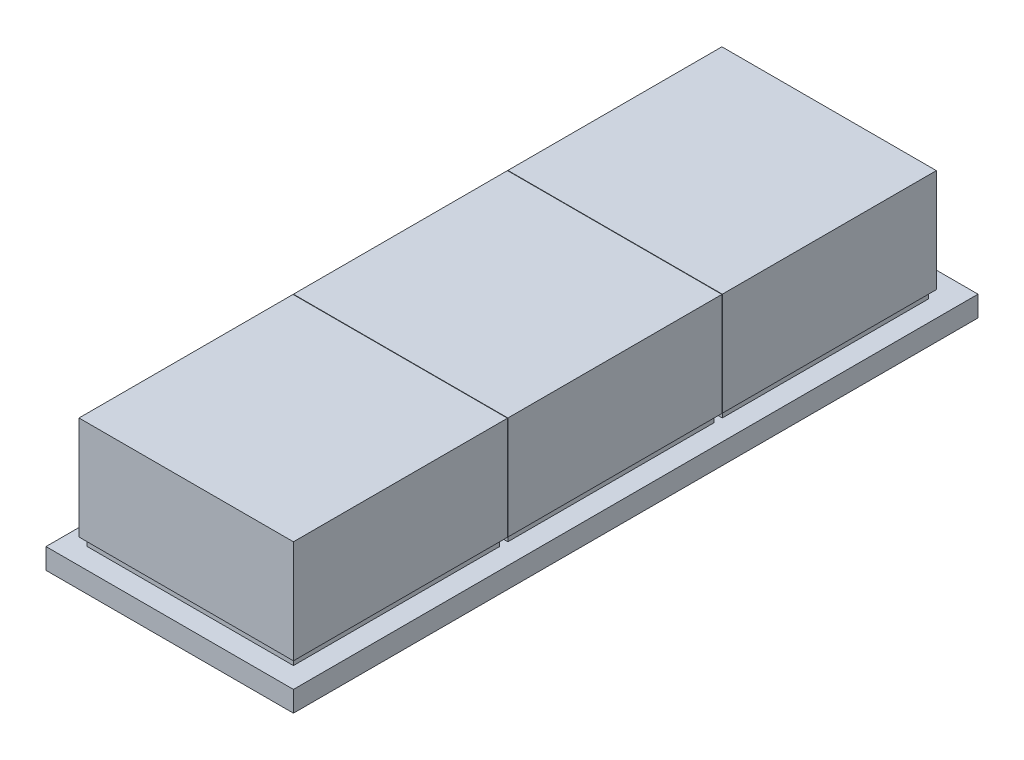
ISO-10303-21;
HEADER;
FILE_DESCRIPTION(('STEP AP214'),'2;1');
FILE_NAME('part.step','',(''),(''),'','','');
FILE_SCHEMA(('AUTOMOTIVE_DESIGN { 1 0 10303 214 1 1 1 1 }'));
ENDSEC;
DATA;
#1=APPLICATION_CONTEXT('core data for automotive mechanical design processes');
#2=APPLICATION_PROTOCOL_DEFINITION('international standard','automotive_design',2000,#1);
#3=PRODUCT_CONTEXT('',#1,'mechanical');
#4=PRODUCT('Part','Part','',(#3));
#5=PRODUCT_RELATED_PRODUCT_CATEGORY('part','',(#4));
#6=PRODUCT_DEFINITION_FORMATION('','',#4);
#7=PRODUCT_DEFINITION_CONTEXT('part definition',#1,'design');
#8=PRODUCT_DEFINITION('design','',#6,#7);
#9=PRODUCT_DEFINITION_SHAPE('','',#8);
#10=(LENGTH_UNIT() NAMED_UNIT(*) SI_UNIT(.MILLI.,.METRE.));
#11=(NAMED_UNIT(*) PLANE_ANGLE_UNIT() SI_UNIT($,.RADIAN.));
#12=(NAMED_UNIT(*) SI_UNIT($,.STERADIAN.) SOLID_ANGLE_UNIT());
#13=UNCERTAINTY_MEASURE_WITH_UNIT(LENGTH_MEASURE(1.E-05),#10,'distance_accuracy_value','');
#14=(GEOMETRIC_REPRESENTATION_CONTEXT(3) GLOBAL_UNCERTAINTY_ASSIGNED_CONTEXT((#13)) GLOBAL_UNIT_ASSIGNED_CONTEXT((#10,
#11,#12)) REPRESENTATION_CONTEXT('',''));
#15=CARTESIAN_POINT('',(0.,0.,0.));
#16=DIRECTION('',(0.,0.,1.));
#17=DIRECTION('',(1.,0.,0.));
#18=AXIS2_PLACEMENT_3D('',#15,#16,#17);
#19=CARTESIAN_POINT('',(-25.,7.,-26.));
#20=DIRECTION('',(0.,0.,-1.));
#21=DIRECTION('',(-1.,0.,0.));
#22=AXIS2_PLACEMENT_3D('',#19,#20,#21);
#23=PLANE('',#22);
#24=DIRECTION('',(1.,0.,0.));
#25=VECTOR('',#24,1.);
#26=CARTESIAN_POINT('',(-25.,5.,-26.));
#27=LINE('',#26,#25);
#28=CARTESIAN_POINT('',(-25.,5.,-26.));
#29=VERTEX_POINT('',#28);
#30=CARTESIAN_POINT('',(25.,5.,-26.));
#31=VERTEX_POINT('',#30);
#32=EDGE_CURVE('E418',#29,#31,#27,.T.);
#33=ORIENTED_EDGE('',*,*,#32,.T.);
#34=DIRECTION('',(0.,-1.,0.));
#35=VECTOR('',#34,1.);
#36=CARTESIAN_POINT('',(25.,7.,-26.));
#37=LINE('',#36,#35);
#38=CARTESIAN_POINT('',(25.,7.,-26.));
#39=VERTEX_POINT('',#38);
#40=EDGE_CURVE('E431',#39,#31,#37,.T.);
#41=ORIENTED_EDGE('',*,*,#40,.F.);
#42=DIRECTION('',(1.,0.,0.));
#43=VECTOR('',#42,1.);
#44=CARTESIAN_POINT('',(-25.,7.,-26.));
#45=LINE('',#44,#43);
#46=CARTESIAN_POINT('',(-25.,7.,-26.));
#47=VERTEX_POINT('',#46);
#48=EDGE_CURVE('E11',#47,#39,#45,.T.);
#49=ORIENTED_EDGE('',*,*,#48,.F.);
#50=DIRECTION('',(0.,-1.,0.));
#51=VECTOR('',#50,1.);
#52=CARTESIAN_POINT('',(-25.,7.,-26.));
#53=LINE('',#52,#51);
#54=EDGE_CURVE('E51',#47,#29,#53,.T.);
#55=ORIENTED_EDGE('',*,*,#54,.T.);
#56=EDGE_LOOP('',(#33,#41,#49,#55));
#57=FACE_BOUND('',#56,.T.);
#58=ADVANCED_FACE('F37',(#57),#23,.F.);
#59=CARTESIAN_POINT('',(-25.,7.,-76.));
#60=DIRECTION('',(1.,0.,0.));
#61=DIRECTION('',(0.,0.,-1.));
#62=AXIS2_PLACEMENT_3D('',#59,#60,#61);
#63=PLANE('',#62);
#64=DIRECTION('',(0.,0.,1.));
#65=VECTOR('',#64,1.);
#66=CARTESIAN_POINT('',(-25.,5.,-76.));
#67=LINE('',#66,#65);
#68=CARTESIAN_POINT('',(-25.,5.,-76.));
#69=VERTEX_POINT('',#68);
#70=EDGE_CURVE('E421',#69,#29,#67,.T.);
#71=ORIENTED_EDGE('',*,*,#70,.T.);
#72=ORIENTED_EDGE('',*,*,#54,.F.);
#73=DIRECTION('',(0.,0.,1.));
#74=VECTOR('',#73,1.);
#75=CARTESIAN_POINT('',(-25.,7.,-76.));
#76=LINE('',#75,#74);
#77=CARTESIAN_POINT('',(-25.,7.,-76.));
#78=VERTEX_POINT('',#77);
#79=EDGE_CURVE('E44',#78,#47,#76,.T.);
#80=ORIENTED_EDGE('',*,*,#79,.F.);
#81=DIRECTION('',(0.,-1.,0.));
#82=VECTOR('',#81,1.);
#83=CARTESIAN_POINT('',(-25.,7.,-76.));
#84=LINE('',#83,#82);
#85=EDGE_CURVE('E59',#78,#69,#84,.T.);
#86=ORIENTED_EDGE('',*,*,#85,.T.);
#87=EDGE_LOOP('',(#71,#72,#80,#86));
#88=FACE_BOUND('',#87,.T.);
#89=ADVANCED_FACE('F441',(#88),#63,.F.);
#90=CARTESIAN_POINT('',(-25.,7.,-76.));
#91=DIRECTION('',(0.,0.,1.));
#92=DIRECTION('',(1.,0.,0.));
#93=AXIS2_PLACEMENT_3D('',#90,#91,#92);
#94=PLANE('',#93);
#95=DIRECTION('',(-1.,0.,0.));
#96=VECTOR('',#95,1.);
#97=CARTESIAN_POINT('',(-25.,5.,-76.));
#98=LINE('',#97,#96);
#99=CARTESIAN_POINT('',(25.,5.,-76.));
#100=VERTEX_POINT('',#99);
#101=EDGE_CURVE('E423',#100,#69,#98,.T.);
#102=ORIENTED_EDGE('',*,*,#101,.T.);
#103=ORIENTED_EDGE('',*,*,#85,.F.);
#104=DIRECTION('',(-1.,0.,0.));
#105=VECTOR('',#104,1.);
#106=CARTESIAN_POINT('',(-25.,7.,-76.));
#107=LINE('',#106,#105);
#108=CARTESIAN_POINT('',(25.,7.,-76.));
#109=VERTEX_POINT('',#108);
#110=EDGE_CURVE('E435',#109,#78,#107,.T.);
#111=ORIENTED_EDGE('',*,*,#110,.F.);
#112=DIRECTION('',(0.,-1.,0.));
#113=VECTOR('',#112,1.);
#114=CARTESIAN_POINT('',(25.,7.,-76.));
#115=LINE('',#114,#113);
#116=EDGE_CURVE('E425',#109,#100,#115,.T.);
#117=ORIENTED_EDGE('',*,*,#116,.T.);
#118=EDGE_LOOP('',(#102,#103,#111,#117));
#119=FACE_BOUND('',#118,.T.);
#120=ADVANCED_FACE('F448',(#119),#94,.F.);
#121=CARTESIAN_POINT('',(25.,7.,-76.));
#122=DIRECTION('',(-1.,0.,0.));
#123=DIRECTION('',(0.,0.,1.));
#124=AXIS2_PLACEMENT_3D('',#121,#122,#123);
#125=PLANE('',#124);
#126=DIRECTION('',(0.,0.,-1.));
#127=VECTOR('',#126,1.);
#128=CARTESIAN_POINT('',(25.,5.,-76.));
#129=LINE('',#128,#127);
#130=EDGE_CURVE('E416',#31,#100,#129,.T.);
#131=ORIENTED_EDGE('',*,*,#130,.T.);
#132=ORIENTED_EDGE('',*,*,#116,.F.);
#133=DIRECTION('',(0.,0.,-1.));
#134=VECTOR('',#133,1.);
#135=CARTESIAN_POINT('',(25.,7.,-76.));
#136=LINE('',#135,#134);
#137=EDGE_CURVE('E428',#39,#109,#136,.T.);
#138=ORIENTED_EDGE('',*,*,#137,.F.);
#139=ORIENTED_EDGE('',*,*,#40,.T.);
#140=EDGE_LOOP('',(#131,#132,#138,#139));
#141=FACE_BOUND('',#140,.T.);
#142=ADVANCED_FACE('F447',(#141),#125,.F.);
#143=CARTESIAN_POINT('',(0.,5.,0.));
#144=DIRECTION('',(0.,-1.,0.));
#145=DIRECTION('',(0.,0.,-1.));
#146=AXIS2_PLACEMENT_3D('',#143,#144,#145);
#147=PLANE('',#146);
#148=DIRECTION('',(0.,0.,-1.));
#149=VECTOR('',#148,1.);
#150=CARTESIAN_POINT('',(25.,5.,28.));
#151=LINE('',#150,#149);
#152=CARTESIAN_POINT('',(25.,5.,78.));
#153=VERTEX_POINT('',#152);
#154=CARTESIAN_POINT('',(25.,5.,28.));
#155=VERTEX_POINT('',#154);
#156=EDGE_CURVE('E350',#153,#155,#151,.T.);
#157=ORIENTED_EDGE('',*,*,#156,.F.);
#158=DIRECTION('',(1.,0.,0.));
#159=VECTOR('',#158,1.);
#160=CARTESIAN_POINT('',(-25.,5.,78.));
#161=LINE('',#160,#159);
#162=CARTESIAN_POINT('',(-25.,5.,78.));
#163=VERTEX_POINT('',#162);
#164=EDGE_CURVE('E355',#163,#153,#161,.T.);
#165=ORIENTED_EDGE('',*,*,#164,.F.);
#166=DIRECTION('',(0.,0.,1.));
#167=VECTOR('',#166,1.);
#168=CARTESIAN_POINT('',(-25.,5.,28.));
#169=LINE('',#168,#167);
#170=CARTESIAN_POINT('',(-25.,5.,28.));
#171=VERTEX_POINT('',#170);
#172=EDGE_CURVE('E370',#171,#163,#169,.T.);
#173=ORIENTED_EDGE('',*,*,#172,.F.);
#174=DIRECTION('',(-1.,0.,0.));
#175=VECTOR('',#174,1.);
#176=CARTESIAN_POINT('',(-25.,5.,28.));
#177=LINE('',#176,#175);
#178=EDGE_CURVE('E367',#155,#171,#177,.T.);
#179=ORIENTED_EDGE('',*,*,#178,.F.);
#180=EDGE_LOOP('',(#157,#165,#173,#179));
#181=FACE_BOUND('',#180,.T.);
#182=DIRECTION('',(0.,0.,-1.));
#183=VECTOR('',#182,1.);
#184=CARTESIAN_POINT('',(30.,5.,83.));
#185=LINE('',#184,#183);
#186=CARTESIAN_POINT('',(30.,5.,83.));
#187=VERTEX_POINT('',#186);
#188=CARTESIAN_POINT('',(30.,5.,-83.));
#189=VERTEX_POINT('',#188);
#190=EDGE_CURVE('E387',#187,#189,#185,.T.);
#191=ORIENTED_EDGE('',*,*,#190,.T.);
#192=DIRECTION('',(-1.,0.,0.));
#193=VECTOR('',#192,1.);
#194=CARTESIAN_POINT('',(-30.,5.,-83.));
#195=LINE('',#194,#193);
#196=CARTESIAN_POINT('',(-30.,5.,-83.));
#197=VERTEX_POINT('',#196);
#198=EDGE_CURVE('E390',#189,#197,#195,.T.);
#199=ORIENTED_EDGE('',*,*,#198,.T.);
#200=DIRECTION('',(0.,0.,1.));
#201=VECTOR('',#200,1.);
#202=CARTESIAN_POINT('',(-30.,5.,83.));
#203=LINE('',#202,#201);
#204=CARTESIAN_POINT('',(-30.,5.,83.));
#205=VERTEX_POINT('',#204);
#206=EDGE_CURVE('E393',#197,#205,#203,.T.);
#207=ORIENTED_EDGE('',*,*,#206,.T.);
#208=DIRECTION('',(1.,0.,0.));
#209=VECTOR('',#208,1.);
#210=CARTESIAN_POINT('',(-30.,5.,83.));
#211=LINE('',#210,#209);
#212=EDGE_CURVE('E395',#205,#187,#211,.T.);
#213=ORIENTED_EDGE('',*,*,#212,.T.);
#214=EDGE_LOOP('',(#191,#199,#207,#213));
#215=FACE_BOUND('',#214,.T.);
#216=DIRECTION('',(0.,0.,-1.));
#217=VECTOR('',#216,1.);
#218=CARTESIAN_POINT('',(25.,5.,-24.));
#219=LINE('',#218,#217);
#220=CARTESIAN_POINT('',(25.,5.,26.));
#221=VERTEX_POINT('',#220);
#222=CARTESIAN_POINT('',(25.,5.,-24.));
#223=VERTEX_POINT('',#222);
#224=EDGE_CURVE('E347',#221,#223,#219,.T.);
#225=ORIENTED_EDGE('',*,*,#224,.F.);
#226=DIRECTION('',(1.,0.,0.));
#227=VECTOR('',#226,1.);
#228=CARTESIAN_POINT('',(-25.,5.,26.));
#229=LINE('',#228,#227);
#230=CARTESIAN_POINT('',(-25.,5.,26.));
#231=VERTEX_POINT('',#230);
#232=EDGE_CURVE('E314',#231,#221,#229,.T.);
#233=ORIENTED_EDGE('',*,*,#232,.F.);
#234=DIRECTION('',(0.,0.,1.));
#235=VECTOR('',#234,1.);
#236=CARTESIAN_POINT('',(-25.,5.,-24.));
#237=LINE('',#236,#235);
#238=CARTESIAN_POINT('',(-25.,5.,-24.));
#239=VERTEX_POINT('',#238);
#240=EDGE_CURVE('E335',#239,#231,#237,.T.);
#241=ORIENTED_EDGE('',*,*,#240,.F.);
#242=DIRECTION('',(-1.,0.,0.));
#243=VECTOR('',#242,1.);
#244=CARTESIAN_POINT('',(-25.,5.,-24.));
#245=LINE('',#244,#243);
#246=EDGE_CURVE('E341',#223,#239,#245,.T.);
#247=ORIENTED_EDGE('',*,*,#246,.F.);
#248=EDGE_LOOP('',(#225,#233,#241,#247));
#249=FACE_BOUND('',#248,.T.);
#250=ORIENTED_EDGE('',*,*,#130,.F.);
#251=ORIENTED_EDGE('',*,*,#32,.F.);
#252=ORIENTED_EDGE('',*,*,#70,.F.);
#253=ORIENTED_EDGE('',*,*,#101,.F.);
#254=EDGE_LOOP('',(#250,#251,#252,#253));
#255=FACE_BOUND('',#254,.T.);
#256=ADVANCED_FACE('F455',(#181,#215,#249,#255),#147,.F.);
#257=CARTESIAN_POINT('',(30.,5.,83.));
#258=DIRECTION('',(-1.,0.,0.));
#259=DIRECTION('',(0.,0.,1.));
#260=AXIS2_PLACEMENT_3D('',#257,#258,#259);
#261=PLANE('',#260);
#262=DIRECTION('',(0.,0.,-1.));
#263=VECTOR('',#262,1.);
#264=CARTESIAN_POINT('',(30.,0.,83.));
#265=LINE('',#264,#263);
#266=CARTESIAN_POINT('',(30.,0.,83.));
#267=VERTEX_POINT('',#266);
#268=CARTESIAN_POINT('',(30.,0.,-83.));
#269=VERTEX_POINT('',#268);
#270=EDGE_CURVE('E386',#267,#269,#265,.T.);
#271=ORIENTED_EDGE('',*,*,#270,.T.);
#272=DIRECTION('',(0.,-1.,0.));
#273=VECTOR('',#272,1.);
#274=CARTESIAN_POINT('',(30.,5.,-83.));
#275=LINE('',#274,#273);
#276=EDGE_CURVE('E413',#189,#269,#275,.T.);
#277=ORIENTED_EDGE('',*,*,#276,.F.);
#278=ORIENTED_EDGE('',*,*,#190,.F.);
#279=DIRECTION('',(0.,-1.,0.));
#280=VECTOR('',#279,1.);
#281=CARTESIAN_POINT('',(30.,5.,83.));
#282=LINE('',#281,#280);
#283=EDGE_CURVE('E397',#187,#267,#282,.T.);
#284=ORIENTED_EDGE('',*,*,#283,.T.);
#285=EDGE_LOOP('',(#271,#277,#278,#284));
#286=FACE_BOUND('',#285,.T.);
#287=ADVANCED_FACE('F736',(#286),#261,.F.);
#288=CARTESIAN_POINT('',(-30.,5.,-83.));
#289=DIRECTION('',(0.,0.,1.));
#290=DIRECTION('',(1.,0.,0.));
#291=AXIS2_PLACEMENT_3D('',#288,#289,#290);
#292=PLANE('',#291);
#293=DIRECTION('',(-1.,0.,0.));
#294=VECTOR('',#293,1.);
#295=CARTESIAN_POINT('',(-30.,0.,-83.));
#296=LINE('',#295,#294);
#297=CARTESIAN_POINT('',(-30.,0.,-83.));
#298=VERTEX_POINT('',#297);
#299=EDGE_CURVE('E400',#269,#298,#296,.T.);
#300=ORIENTED_EDGE('',*,*,#299,.T.);
#301=DIRECTION('',(0.,-1.,0.));
#302=VECTOR('',#301,1.);
#303=CARTESIAN_POINT('',(-30.,5.,-83.));
#304=LINE('',#303,#302);
#305=EDGE_CURVE('E410',#197,#298,#304,.T.);
#306=ORIENTED_EDGE('',*,*,#305,.F.);
#307=ORIENTED_EDGE('',*,*,#198,.F.);
#308=ORIENTED_EDGE('',*,*,#276,.T.);
#309=EDGE_LOOP('',(#300,#306,#307,#308));
#310=FACE_BOUND('',#309,.T.);
#311=ADVANCED_FACE('F797',(#310),#292,.F.);
#312=CARTESIAN_POINT('',(-30.,5.,83.));
#313=DIRECTION('',(1.,0.,0.));
#314=DIRECTION('',(0.,0.,-1.));
#315=AXIS2_PLACEMENT_3D('',#312,#313,#314);
#316=PLANE('',#315);
#317=DIRECTION('',(0.,0.,1.));
#318=VECTOR('',#317,1.);
#319=CARTESIAN_POINT('',(-30.,0.,83.));
#320=LINE('',#319,#318);
#321=CARTESIAN_POINT('',(-30.,0.,83.));
#322=VERTEX_POINT('',#321);
#323=EDGE_CURVE('E402',#298,#322,#320,.T.);
#324=ORIENTED_EDGE('',*,*,#323,.T.);
#325=DIRECTION('',(0.,-1.,0.));
#326=VECTOR('',#325,1.);
#327=CARTESIAN_POINT('',(-30.,5.,83.));
#328=LINE('',#327,#326);
#329=EDGE_CURVE('E407',#205,#322,#328,.T.);
#330=ORIENTED_EDGE('',*,*,#329,.F.);
#331=ORIENTED_EDGE('',*,*,#206,.F.);
#332=ORIENTED_EDGE('',*,*,#305,.T.);
#333=EDGE_LOOP('',(#324,#330,#331,#332));
#334=FACE_BOUND('',#333,.T.);
#335=ADVANCED_FACE('F788',(#334),#316,.F.);
#336=CARTESIAN_POINT('',(-30.,5.,83.));
#337=DIRECTION('',(0.,0.,-1.));
#338=DIRECTION('',(-1.,0.,0.));
#339=AXIS2_PLACEMENT_3D('',#336,#337,#338);
#340=PLANE('',#339);
#341=DIRECTION('',(1.,0.,0.));
#342=VECTOR('',#341,1.);
#343=CARTESIAN_POINT('',(-30.,0.,83.));
#344=LINE('',#343,#342);
#345=EDGE_CURVE('E391',#322,#267,#344,.T.);
#346=ORIENTED_EDGE('',*,*,#345,.T.);
#347=ORIENTED_EDGE('',*,*,#283,.F.);
#348=ORIENTED_EDGE('',*,*,#212,.F.);
#349=ORIENTED_EDGE('',*,*,#329,.T.);
#350=EDGE_LOOP('',(#346,#347,#348,#349));
#351=FACE_BOUND('',#350,.T.);
#352=ADVANCED_FACE('F779',(#351),#340,.F.);
#353=CARTESIAN_POINT('',(0.,0.,0.));
#354=DIRECTION('',(0.,-1.,0.));
#355=DIRECTION('',(0.,0.,-1.));
#356=AXIS2_PLACEMENT_3D('',#353,#354,#355);
#357=PLANE('',#356);
#358=ORIENTED_EDGE('',*,*,#270,.F.);
#359=ORIENTED_EDGE('',*,*,#345,.F.);
#360=ORIENTED_EDGE('',*,*,#323,.F.);
#361=ORIENTED_EDGE('',*,*,#299,.F.);
#362=EDGE_LOOP('',(#358,#359,#360,#361));
#363=FACE_BOUND('',#362,.T.);
#364=ADVANCED_FACE('F771',(#363),#357,.T.);
#365=CARTESIAN_POINT('',(25.,7.,28.));
#366=DIRECTION('',(-1.,0.,0.));
#367=DIRECTION('',(0.,0.,1.));
#368=AXIS2_PLACEMENT_3D('',#365,#366,#367);
#369=PLANE('',#368);
#370=ORIENTED_EDGE('',*,*,#156,.T.);
#371=DIRECTION('',(0.,-1.,0.));
#372=VECTOR('',#371,1.);
#373=CARTESIAN_POINT('',(25.,7.,28.));
#374=LINE('',#373,#372);
#375=CARTESIAN_POINT('',(25.,7.,28.));
#376=VERTEX_POINT('',#375);
#377=EDGE_CURVE('E383',#376,#155,#374,.T.);
#378=ORIENTED_EDGE('',*,*,#377,.F.);
#379=DIRECTION('',(0.,0.,-1.));
#380=VECTOR('',#379,1.);
#381=CARTESIAN_POINT('',(25.,7.,28.));
#382=LINE('',#381,#380);
#383=CARTESIAN_POINT('',(25.,7.,78.));
#384=VERTEX_POINT('',#383);
#385=EDGE_CURVE('E351',#384,#376,#382,.T.);
#386=ORIENTED_EDGE('',*,*,#385,.F.);
#387=DIRECTION('',(0.,-1.,0.));
#388=VECTOR('',#387,1.);
#389=CARTESIAN_POINT('',(25.,7.,78.));
#390=LINE('',#389,#388);
#391=EDGE_CURVE('E364',#384,#153,#390,.T.);
#392=ORIENTED_EDGE('',*,*,#391,.T.);
#393=EDGE_LOOP('',(#370,#378,#386,#392));
#394=FACE_BOUND('',#393,.T.);
#395=ADVANCED_FACE('F763',(#394),#369,.F.);
#396=CARTESIAN_POINT('',(-25.,7.,28.));
#397=DIRECTION('',(0.,0.,1.));
#398=DIRECTION('',(1.,0.,0.));
#399=AXIS2_PLACEMENT_3D('',#396,#397,#398);
#400=PLANE('',#399);
#401=ORIENTED_EDGE('',*,*,#178,.T.);
#402=DIRECTION('',(0.,-1.,0.));
#403=VECTOR('',#402,1.);
#404=CARTESIAN_POINT('',(-25.,7.,28.));
#405=LINE('',#404,#403);
#406=CARTESIAN_POINT('',(-25.,7.,28.));
#407=VERTEX_POINT('',#406);
#408=EDGE_CURVE('E380',#407,#171,#405,.T.);
#409=ORIENTED_EDGE('',*,*,#408,.F.);
#410=DIRECTION('',(-1.,0.,0.));
#411=VECTOR('',#410,1.);
#412=CARTESIAN_POINT('',(-25.,7.,28.));
#413=LINE('',#412,#411);
#414=EDGE_CURVE('E354',#376,#407,#413,.T.);
#415=ORIENTED_EDGE('',*,*,#414,.F.);
#416=ORIENTED_EDGE('',*,*,#377,.T.);
#417=EDGE_LOOP('',(#401,#409,#415,#416));
#418=FACE_BOUND('',#417,.T.);
#419=ADVANCED_FACE('F754',(#418),#400,.F.);
#420=CARTESIAN_POINT('',(-25.,7.,28.));
#421=DIRECTION('',(1.,0.,0.));
#422=DIRECTION('',(0.,0.,-1.));
#423=AXIS2_PLACEMENT_3D('',#420,#421,#422);
#424=PLANE('',#423);
#425=ORIENTED_EDGE('',*,*,#172,.T.);
#426=DIRECTION('',(0.,-1.,0.));
#427=VECTOR('',#426,1.);
#428=CARTESIAN_POINT('',(-25.,7.,78.));
#429=LINE('',#428,#427);
#430=CARTESIAN_POINT('',(-25.,7.,78.));
#431=VERTEX_POINT('',#430);
#432=EDGE_CURVE('E377',#431,#163,#429,.T.);
#433=ORIENTED_EDGE('',*,*,#432,.F.);
#434=DIRECTION('',(0.,0.,1.));
#435=VECTOR('',#434,1.);
#436=CARTESIAN_POINT('',(-25.,7.,28.));
#437=LINE('',#436,#435);
#438=EDGE_CURVE('E358',#407,#431,#437,.T.);
#439=ORIENTED_EDGE('',*,*,#438,.F.);
#440=ORIENTED_EDGE('',*,*,#408,.T.);
#441=EDGE_LOOP('',(#425,#433,#439,#440));
#442=FACE_BOUND('',#441,.T.);
#443=ADVANCED_FACE('F745',(#442),#424,.F.);
#444=CARTESIAN_POINT('',(-25.,7.,78.));
#445=DIRECTION('',(0.,0.,-1.));
#446=DIRECTION('',(-1.,0.,0.));
#447=AXIS2_PLACEMENT_3D('',#444,#445,#446);
#448=PLANE('',#447);
#449=ORIENTED_EDGE('',*,*,#164,.T.);
#450=ORIENTED_EDGE('',*,*,#391,.F.);
#451=DIRECTION('',(1.,0.,0.));
#452=VECTOR('',#451,1.);
#453=CARTESIAN_POINT('',(-25.,7.,78.));
#454=LINE('',#453,#452);
#455=EDGE_CURVE('E361',#431,#384,#454,.T.);
#456=ORIENTED_EDGE('',*,*,#455,.F.);
#457=ORIENTED_EDGE('',*,*,#432,.T.);
#458=EDGE_LOOP('',(#449,#450,#456,#457));
#459=FACE_BOUND('',#458,.T.);
#460=ADVANCED_FACE('F482',(#459),#448,.F.);
#461=CARTESIAN_POINT('',(25.,7.,-24.));
#462=DIRECTION('',(-1.,0.,0.));
#463=DIRECTION('',(0.,0.,1.));
#464=AXIS2_PLACEMENT_3D('',#461,#462,#463);
#465=PLANE('',#464);
#466=ORIENTED_EDGE('',*,*,#224,.T.);
#467=DIRECTION('',(0.,-1.,0.));
#468=VECTOR('',#467,1.);
#469=CARTESIAN_POINT('',(25.,7.,-24.));
#470=LINE('',#469,#468);
#471=CARTESIAN_POINT('',(25.,7.,-24.));
#472=VERTEX_POINT('',#471);
#473=EDGE_CURVE('E344',#472,#223,#470,.T.);
#474=ORIENTED_EDGE('',*,*,#473,.F.);
#475=DIRECTION('',(0.,0.,-1.));
#476=VECTOR('',#475,1.);
#477=CARTESIAN_POINT('',(25.,7.,-24.));
#478=LINE('',#477,#476);
#479=CARTESIAN_POINT('',(25.,7.,26.));
#480=VERTEX_POINT('',#479);
#481=EDGE_CURVE('E317',#480,#472,#478,.T.);
#482=ORIENTED_EDGE('',*,*,#481,.F.);
#483=DIRECTION('',(0.,-1.,0.));
#484=VECTOR('',#483,1.);
#485=CARTESIAN_POINT('',(25.,7.,26.));
#486=LINE('',#485,#484);
#487=EDGE_CURVE('E329',#480,#221,#486,.T.);
#488=ORIENTED_EDGE('',*,*,#487,.T.);
#489=EDGE_LOOP('',(#466,#474,#482,#488));
#490=FACE_BOUND('',#489,.T.);
#491=ADVANCED_FACE('F476',(#490),#465,.F.);
#492=CARTESIAN_POINT('',(-25.,7.,-24.));
#493=DIRECTION('',(0.,0.,1.));
#494=DIRECTION('',(1.,0.,0.));
#495=AXIS2_PLACEMENT_3D('',#492,#493,#494);
#496=PLANE('',#495);
#497=ORIENTED_EDGE('',*,*,#246,.T.);
#498=DIRECTION('',(0.,-1.,0.));
#499=VECTOR('',#498,1.);
#500=CARTESIAN_POINT('',(-25.,7.,-24.));
#501=LINE('',#500,#499);
#502=CARTESIAN_POINT('',(-25.,7.,-24.));
#503=VERTEX_POINT('',#502);
#504=EDGE_CURVE('E338',#503,#239,#501,.T.);
#505=ORIENTED_EDGE('',*,*,#504,.F.);
#506=DIRECTION('',(-1.,0.,0.));
#507=VECTOR('',#506,1.);
#508=CARTESIAN_POINT('',(-25.,7.,-24.));
#509=LINE('',#508,#507);
#510=EDGE_CURVE('E320',#472,#503,#509,.T.);
#511=ORIENTED_EDGE('',*,*,#510,.F.);
#512=ORIENTED_EDGE('',*,*,#473,.T.);
#513=EDGE_LOOP('',(#497,#505,#511,#512));
#514=FACE_BOUND('',#513,.T.);
#515=ADVANCED_FACE('F481',(#514),#496,.F.);
#516=CARTESIAN_POINT('',(-25.,7.,-24.));
#517=DIRECTION('',(1.,0.,0.));
#518=DIRECTION('',(0.,0.,-1.));
#519=AXIS2_PLACEMENT_3D('',#516,#517,#518);
#520=PLANE('',#519);
#521=ORIENTED_EDGE('',*,*,#240,.T.);
#522=DIRECTION('',(0.,-1.,0.));
#523=VECTOR('',#522,1.);
#524=CARTESIAN_POINT('',(-25.,7.,26.));
#525=LINE('',#524,#523);
#526=CARTESIAN_POINT('',(-25.,7.,26.));
#527=VERTEX_POINT('',#526);
#528=EDGE_CURVE('E332',#527,#231,#525,.T.);
#529=ORIENTED_EDGE('',*,*,#528,.F.);
#530=DIRECTION('',(0.,0.,1.));
#531=VECTOR('',#530,1.);
#532=CARTESIAN_POINT('',(-25.,7.,-24.));
#533=LINE('',#532,#531);
#534=EDGE_CURVE('E323',#503,#527,#533,.T.);
#535=ORIENTED_EDGE('',*,*,#534,.F.);
#536=ORIENTED_EDGE('',*,*,#504,.T.);
#537=EDGE_LOOP('',(#521,#529,#535,#536));
#538=FACE_BOUND('',#537,.T.);
#539=ADVANCED_FACE('F491',(#538),#520,.F.);
#540=CARTESIAN_POINT('',(-25.,7.,26.));
#541=DIRECTION('',(0.,0.,-1.));
#542=DIRECTION('',(-1.,0.,0.));
#543=AXIS2_PLACEMENT_3D('',#540,#541,#542);
#544=PLANE('',#543);
#545=ORIENTED_EDGE('',*,*,#232,.T.);
#546=ORIENTED_EDGE('',*,*,#487,.F.);
#547=DIRECTION('',(1.,0.,0.));
#548=VECTOR('',#547,1.);
#549=CARTESIAN_POINT('',(-25.,7.,26.));
#550=LINE('',#549,#548);
#551=EDGE_CURVE('E326',#527,#480,#550,.T.);
#552=ORIENTED_EDGE('',*,*,#551,.F.);
#553=ORIENTED_EDGE('',*,*,#528,.T.);
#554=EDGE_LOOP('',(#545,#546,#552,#553));
#555=FACE_BOUND('',#554,.T.);
#556=ADVANCED_FACE('F496',(#555),#544,.F.);
#557=CARTESIAN_POINT('',(0.,7.,0.));
#558=DIRECTION('',(0.,1.,0.));
#559=DIRECTION('',(0.,0.,1.));
#560=AXIS2_PLACEMENT_3D('',#557,#558,#559);
#561=PLANE('',#560);
#562=DIRECTION('',(0.,0.,-1.));
#563=VECTOR('',#562,1.);
#564=CARTESIAN_POINT('',(26.,7.,27.1));
#565=LINE('',#564,#563);
#566=CARTESIAN_POINT('',(26.,7.,79.));
#567=VERTEX_POINT('',#566);
#568=CARTESIAN_POINT('',(26.,7.,27.1));
#569=VERTEX_POINT('',#568);
#570=EDGE_CURVE('E284',#567,#569,#565,.T.);
#571=ORIENTED_EDGE('',*,*,#570,.F.);
#572=DIRECTION('',(1.,0.,0.));
#573=VECTOR('',#572,1.);
#574=CARTESIAN_POINT('',(-26.,7.,79.));
#575=LINE('',#574,#573);
#576=CARTESIAN_POINT('',(-26.,7.,79.));
#577=VERTEX_POINT('',#576);
#578=EDGE_CURVE('E289',#577,#567,#575,.T.);
#579=ORIENTED_EDGE('',*,*,#578,.F.);
#580=DIRECTION('',(0.,0.,1.));
#581=VECTOR('',#580,1.);
#582=CARTESIAN_POINT('',(-26.,7.,27.1));
#583=LINE('',#582,#581);
#584=CARTESIAN_POINT('',(-26.,7.,27.1));
#585=VERTEX_POINT('',#584);
#586=EDGE_CURVE('E300',#585,#577,#583,.T.);
#587=ORIENTED_EDGE('',*,*,#586,.F.);
#588=DIRECTION('',(-1.,0.,0.));
#589=VECTOR('',#588,1.);
#590=CARTESIAN_POINT('',(-26.,7.,27.1));
#591=LINE('',#590,#589);
#592=EDGE_CURVE('E298',#569,#585,#591,.T.);
#593=ORIENTED_EDGE('',*,*,#592,.F.);
#594=EDGE_LOOP('',(#571,#579,#587,#593));
#595=FACE_BOUND('',#594,.T.);
#596=ORIENTED_EDGE('',*,*,#455,.T.);
#597=ORIENTED_EDGE('',*,*,#385,.T.);
#598=ORIENTED_EDGE('',*,*,#414,.T.);
#599=ORIENTED_EDGE('',*,*,#438,.T.);
#600=EDGE_LOOP('',(#596,#597,#598,#599));
#601=FACE_BOUND('',#600,.T.);
#602=ADVANCED_FACE('F622',(#595,#601),#561,.F.);
#603=CARTESIAN_POINT('',(26.,32.,27.1));
#604=DIRECTION('',(-1.,0.,0.));
#605=DIRECTION('',(0.,0.,1.));
#606=AXIS2_PLACEMENT_3D('',#603,#604,#605);
#607=PLANE('',#606);
#608=ORIENTED_EDGE('',*,*,#570,.T.);
#609=DIRECTION('',(0.,-1.,0.));
#610=VECTOR('',#609,1.);
#611=CARTESIAN_POINT('',(26.,32.,27.1));
#612=LINE('',#611,#610);
#613=CARTESIAN_POINT('',(26.,32.,27.1));
#614=VERTEX_POINT('',#613);
#615=EDGE_CURVE('E311',#614,#569,#612,.T.);
#616=ORIENTED_EDGE('',*,*,#615,.F.);
#617=DIRECTION('',(0.,0.,-1.));
#618=VECTOR('',#617,1.);
#619=CARTESIAN_POINT('',(26.,32.,27.1));
#620=LINE('',#619,#618);
#621=CARTESIAN_POINT('',(26.,32.,79.));
#622=VERTEX_POINT('',#621);
#623=EDGE_CURVE('E285',#622,#614,#620,.T.);
#624=ORIENTED_EDGE('',*,*,#623,.F.);
#625=DIRECTION('',(0.,-1.,0.));
#626=VECTOR('',#625,1.);
#627=CARTESIAN_POINT('',(26.,32.,79.));
#628=LINE('',#627,#626);
#629=EDGE_CURVE('E295',#622,#567,#628,.T.);
#630=ORIENTED_EDGE('',*,*,#629,.T.);
#631=EDGE_LOOP('',(#608,#616,#624,#630));
#632=FACE_BOUND('',#631,.T.);
#633=ADVANCED_FACE('F691',(#632),#607,.F.);
#634=CARTESIAN_POINT('',(-26.,32.,27.1));
#635=DIRECTION('',(0.,0.,1.));
#636=DIRECTION('',(1.,0.,0.));
#637=AXIS2_PLACEMENT_3D('',#634,#635,#636);
#638=PLANE('',#637);
#639=ORIENTED_EDGE('',*,*,#592,.T.);
#640=DIRECTION('',(0.,-1.,0.));
#641=VECTOR('',#640,1.);
#642=CARTESIAN_POINT('',(-26.,32.,27.1));
#643=LINE('',#642,#641);
#644=CARTESIAN_POINT('',(-26.,32.,27.1));
#645=VERTEX_POINT('',#644);
#646=EDGE_CURVE('E308',#645,#585,#643,.T.);
#647=ORIENTED_EDGE('',*,*,#646,.F.);
#648=DIRECTION('',(-1.,0.,0.));
#649=VECTOR('',#648,1.);
#650=CARTESIAN_POINT('',(-26.,32.,27.1));
#651=LINE('',#650,#649);
#652=EDGE_CURVE('E288',#614,#645,#651,.T.);
#653=ORIENTED_EDGE('',*,*,#652,.F.);
#654=ORIENTED_EDGE('',*,*,#615,.T.);
#655=EDGE_LOOP('',(#639,#647,#653,#654));
#656=FACE_BOUND('',#655,.T.);
#657=ADVANCED_FACE('F682',(#656),#638,.F.);
#658=CARTESIAN_POINT('',(-26.,32.,27.1));
#659=DIRECTION('',(1.,0.,0.));
#660=DIRECTION('',(0.,0.,-1.));
#661=AXIS2_PLACEMENT_3D('',#658,#659,#660);
#662=PLANE('',#661);
#663=ORIENTED_EDGE('',*,*,#586,.T.);
#664=DIRECTION('',(0.,-1.,0.));
#665=VECTOR('',#664,1.);
#666=CARTESIAN_POINT('',(-26.,32.,79.));
#667=LINE('',#666,#665);
#668=CARTESIAN_POINT('',(-26.,32.,79.));
#669=VERTEX_POINT('',#668);
#670=EDGE_CURVE('E305',#669,#577,#667,.T.);
#671=ORIENTED_EDGE('',*,*,#670,.F.);
#672=DIRECTION('',(0.,0.,1.));
#673=VECTOR('',#672,1.);
#674=CARTESIAN_POINT('',(-26.,32.,27.1));
#675=LINE('',#674,#673);
#676=EDGE_CURVE('E291',#645,#669,#675,.T.);
#677=ORIENTED_EDGE('',*,*,#676,.F.);
#678=ORIENTED_EDGE('',*,*,#646,.T.);
#679=EDGE_LOOP('',(#663,#671,#677,#678));
#680=FACE_BOUND('',#679,.T.);
#681=ADVANCED_FACE('F673',(#680),#662,.F.);
#682=CARTESIAN_POINT('',(-26.,32.,79.));
#683=DIRECTION('',(0.,0.,-1.));
#684=DIRECTION('',(-1.,0.,0.));
#685=AXIS2_PLACEMENT_3D('',#682,#683,#684);
#686=PLANE('',#685);
#687=ORIENTED_EDGE('',*,*,#578,.T.);
#688=ORIENTED_EDGE('',*,*,#629,.F.);
#689=DIRECTION('',(1.,0.,0.));
#690=VECTOR('',#689,1.);
#691=CARTESIAN_POINT('',(-26.,32.,79.));
#692=LINE('',#691,#690);
#693=EDGE_CURVE('E293',#669,#622,#692,.T.);
#694=ORIENTED_EDGE('',*,*,#693,.F.);
#695=ORIENTED_EDGE('',*,*,#670,.T.);
#696=EDGE_LOOP('',(#687,#688,#694,#695));
#697=FACE_BOUND('',#696,.T.);
#698=ADVANCED_FACE('F664',(#697),#686,.F.);
#699=CARTESIAN_POINT('',(0.,32.,0.));
#700=DIRECTION('',(0.,1.,0.));
#701=DIRECTION('',(0.,0.,1.));
#702=AXIS2_PLACEMENT_3D('',#699,#700,#701);
#703=PLANE('',#702);
#704=ORIENTED_EDGE('',*,*,#623,.T.);
#705=ORIENTED_EDGE('',*,*,#652,.T.);
#706=ORIENTED_EDGE('',*,*,#676,.T.);
#707=ORIENTED_EDGE('',*,*,#693,.T.);
#708=EDGE_LOOP('',(#704,#705,#706,#707));
#709=FACE_BOUND('',#708,.T.);
#710=ADVANCED_FACE('F577',(#709),#703,.T.);
#711=CARTESIAN_POINT('',(0.,7.,-52.));
#712=DIRECTION('',(0.,1.,0.));
#713=DIRECTION('',(0.,0.,1.));
#714=AXIS2_PLACEMENT_3D('',#711,#712,#713);
#715=PLANE('',#714);
#716=DIRECTION('',(0.,0.,-1.));
#717=VECTOR('',#716,1.);
#718=CARTESIAN_POINT('',(26.,7.,-24.9));
#719=LINE('',#718,#717);
#720=CARTESIAN_POINT('',(26.,7.,27.));
#721=VERTEX_POINT('',#720);
#722=CARTESIAN_POINT('',(26.,7.,-24.9));
#723=VERTEX_POINT('',#722);
#724=EDGE_CURVE('E249',#721,#723,#719,.T.);
#725=ORIENTED_EDGE('',*,*,#724,.F.);
#726=DIRECTION('',(1.,0.,0.));
#727=VECTOR('',#726,1.);
#728=CARTESIAN_POINT('',(-26.,7.,27.));
#729=LINE('',#728,#727);
#730=CARTESIAN_POINT('',(-26.,7.,27.));
#731=VERTEX_POINT('',#730);
#732=EDGE_CURVE('E262',#731,#721,#729,.T.);
#733=ORIENTED_EDGE('',*,*,#732,.F.);
#734=DIRECTION('',(0.,0.,1.));
#735=VECTOR('',#734,1.);
#736=CARTESIAN_POINT('',(-26.,7.,-24.9));
#737=LINE('',#736,#735);
#738=CARTESIAN_POINT('',(-26.,7.,-24.9));
#739=VERTEX_POINT('',#738);
#740=EDGE_CURVE('E270',#739,#731,#737,.T.);
#741=ORIENTED_EDGE('',*,*,#740,.F.);
#742=DIRECTION('',(-1.,0.,0.));
#743=VECTOR('',#742,1.);
#744=CARTESIAN_POINT('',(-26.,7.,-24.9));
#745=LINE('',#744,#743);
#746=EDGE_CURVE('E252',#723,#739,#745,.T.);
#747=ORIENTED_EDGE('',*,*,#746,.F.);
#748=EDGE_LOOP('',(#725,#733,#741,#747));
#749=FACE_BOUND('',#748,.T.);
#750=ORIENTED_EDGE('',*,*,#551,.T.);
#751=ORIENTED_EDGE('',*,*,#481,.T.);
#752=ORIENTED_EDGE('',*,*,#510,.T.);
#753=ORIENTED_EDGE('',*,*,#534,.T.);
#754=EDGE_LOOP('',(#750,#751,#752,#753));
#755=FACE_BOUND('',#754,.T.);
#756=ADVANCED_FACE('F571',(#749,#755),#715,.F.);
#757=CARTESIAN_POINT('',(26.,32.,-24.9));
#758=DIRECTION('',(-1.,0.,0.));
#759=DIRECTION('',(0.,0.,1.));
#760=AXIS2_PLACEMENT_3D('',#757,#758,#759);
#761=PLANE('',#760);
#762=ORIENTED_EDGE('',*,*,#724,.T.);
#763=DIRECTION('',(0.,-1.,0.));
#764=VECTOR('',#763,1.);
#765=CARTESIAN_POINT('',(26.,32.,-24.9));
#766=LINE('',#765,#764);
#767=CARTESIAN_POINT('',(26.,32.,-24.9));
#768=VERTEX_POINT('',#767);
#769=EDGE_CURVE('E281',#768,#723,#766,.T.);
#770=ORIENTED_EDGE('',*,*,#769,.F.);
#771=DIRECTION('',(0.,0.,-1.));
#772=VECTOR('',#771,1.);
#773=CARTESIAN_POINT('',(26.,32.,-24.9));
#774=LINE('',#773,#772);
#775=CARTESIAN_POINT('',(26.,32.,27.));
#776=VERTEX_POINT('',#775);
#777=EDGE_CURVE('E258',#776,#768,#774,.T.);
#778=ORIENTED_EDGE('',*,*,#777,.F.);
#779=DIRECTION('',(0.,-1.,0.));
#780=VECTOR('',#779,1.);
#781=CARTESIAN_POINT('',(26.,32.,27.));
#782=LINE('',#781,#780);
#783=EDGE_CURVE('E267',#776,#721,#782,.T.);
#784=ORIENTED_EDGE('',*,*,#783,.T.);
#785=EDGE_LOOP('',(#762,#770,#778,#784));
#786=FACE_BOUND('',#785,.T.);
#787=ADVANCED_FACE('F576',(#786),#761,.F.);
#788=CARTESIAN_POINT('',(-26.,32.,-24.9));
#789=DIRECTION('',(0.,0.,1.));
#790=DIRECTION('',(1.,0.,0.));
#791=AXIS2_PLACEMENT_3D('',#788,#789,#790);
#792=PLANE('',#791);
#793=ORIENTED_EDGE('',*,*,#746,.T.);
#794=DIRECTION('',(0.,-1.,0.));
#795=VECTOR('',#794,1.);
#796=CARTESIAN_POINT('',(-26.,32.,-24.9));
#797=LINE('',#796,#795);
#798=CARTESIAN_POINT('',(-26.,32.,-24.9));
#799=VERTEX_POINT('',#798);
#800=EDGE_CURVE('E278',#799,#739,#797,.T.);
#801=ORIENTED_EDGE('',*,*,#800,.F.);
#802=DIRECTION('',(-1.,0.,0.));
#803=VECTOR('',#802,1.);
#804=CARTESIAN_POINT('',(-26.,32.,-24.9));
#805=LINE('',#804,#803);
#806=EDGE_CURVE('E261',#768,#799,#805,.T.);
#807=ORIENTED_EDGE('',*,*,#806,.F.);
#808=ORIENTED_EDGE('',*,*,#769,.T.);
#809=EDGE_LOOP('',(#793,#801,#807,#808));
#810=FACE_BOUND('',#809,.T.);
#811=ADVANCED_FACE('F605',(#810),#792,.F.);
#812=CARTESIAN_POINT('',(-26.,32.,-24.9));
#813=DIRECTION('',(1.,0.,0.));
#814=DIRECTION('',(0.,0.,-1.));
#815=AXIS2_PLACEMENT_3D('',#812,#813,#814);
#816=PLANE('',#815);
#817=ORIENTED_EDGE('',*,*,#740,.T.);
#818=DIRECTION('',(0.,-1.,0.));
#819=VECTOR('',#818,1.);
#820=CARTESIAN_POINT('',(-26.,32.,27.));
#821=LINE('',#820,#819);
#822=CARTESIAN_POINT('',(-26.,32.,27.));
#823=VERTEX_POINT('',#822);
#824=EDGE_CURVE('E275',#823,#731,#821,.T.);
#825=ORIENTED_EDGE('',*,*,#824,.F.);
#826=DIRECTION('',(0.,0.,1.));
#827=VECTOR('',#826,1.);
#828=CARTESIAN_POINT('',(-26.,32.,-24.9));
#829=LINE('',#828,#827);
#830=EDGE_CURVE('E264',#799,#823,#829,.T.);
#831=ORIENTED_EDGE('',*,*,#830,.F.);
#832=ORIENTED_EDGE('',*,*,#800,.T.);
#833=EDGE_LOOP('',(#817,#825,#831,#832));
#834=FACE_BOUND('',#833,.T.);
#835=ADVANCED_FACE('F588',(#834),#816,.F.);
#836=CARTESIAN_POINT('',(-26.,32.,27.));
#837=DIRECTION('',(0.,0.,-1.));
#838=DIRECTION('',(-1.,0.,0.));
#839=AXIS2_PLACEMENT_3D('',#836,#837,#838);
#840=PLANE('',#839);
#841=ORIENTED_EDGE('',*,*,#732,.T.);
#842=ORIENTED_EDGE('',*,*,#783,.F.);
#843=DIRECTION('',(1.,0.,0.));
#844=VECTOR('',#843,1.);
#845=CARTESIAN_POINT('',(-26.,32.,27.));
#846=LINE('',#845,#844);
#847=EDGE_CURVE('E266',#823,#776,#846,.T.);
#848=ORIENTED_EDGE('',*,*,#847,.F.);
#849=ORIENTED_EDGE('',*,*,#824,.T.);
#850=EDGE_LOOP('',(#841,#842,#848,#849));
#851=FACE_BOUND('',#850,.T.);
#852=ADVANCED_FACE('F563',(#851),#840,.F.);
#853=CARTESIAN_POINT('',(0.,32.,-52.));
#854=DIRECTION('',(0.,1.,0.));
#855=DIRECTION('',(0.,0.,1.));
#856=AXIS2_PLACEMENT_3D('',#853,#854,#855);
#857=PLANE('',#856);
#858=ORIENTED_EDGE('',*,*,#777,.T.);
#859=ORIENTED_EDGE('',*,*,#806,.T.);
#860=ORIENTED_EDGE('',*,*,#830,.T.);
#861=ORIENTED_EDGE('',*,*,#847,.T.);
#862=EDGE_LOOP('',(#858,#859,#860,#861));
#863=FACE_BOUND('',#862,.T.);
#864=ADVANCED_FACE('F519',(#863),#857,.T.);
#865=CARTESIAN_POINT('',(0.,7.,-104.));
#866=DIRECTION('',(0.,1.,0.));
#867=DIRECTION('',(0.,0.,1.));
#868=AXIS2_PLACEMENT_3D('',#865,#866,#867);
#869=PLANE('',#868);
#870=DIRECTION('',(0.,0.,-1.));
#871=VECTOR('',#870,1.);
#872=CARTESIAN_POINT('',(26.,7.,-76.9));
#873=LINE('',#872,#871);
#874=CARTESIAN_POINT('',(26.,7.,-25.));
#875=VERTEX_POINT('',#874);
#876=CARTESIAN_POINT('',(26.,7.,-76.9));
#877=VERTEX_POINT('',#876);
#878=EDGE_CURVE('E248',#875,#877,#873,.T.);
#879=ORIENTED_EDGE('',*,*,#878,.F.);
#880=DIRECTION('',(1.,0.,0.));
#881=VECTOR('',#880,1.);
#882=CARTESIAN_POINT('',(-26.,7.,-25.));
#883=LINE('',#882,#881);
#884=CARTESIAN_POINT('',(-26.,7.,-25.));
#885=VERTEX_POINT('',#884);
#886=EDGE_CURVE('E244',#885,#875,#883,.T.);
#887=ORIENTED_EDGE('',*,*,#886,.F.);
#888=DIRECTION('',(0.,0.,1.));
#889=VECTOR('',#888,1.);
#890=CARTESIAN_POINT('',(-26.,7.,-76.9));
#891=LINE('',#890,#889);
#892=CARTESIAN_POINT('',(-26.,7.,-76.9));
#893=VERTEX_POINT('',#892);
#894=EDGE_CURVE('E877',#893,#885,#891,.T.);
#895=ORIENTED_EDGE('',*,*,#894,.F.);
#896=DIRECTION('',(-1.,0.,0.));
#897=VECTOR('',#896,1.);
#898=CARTESIAN_POINT('',(-26.,7.,-76.9));
#899=LINE('',#898,#897);
#900=EDGE_CURVE('E880',#877,#893,#899,.T.);
#901=ORIENTED_EDGE('',*,*,#900,.F.);
#902=EDGE_LOOP('',(#879,#887,#895,#901));
#903=FACE_BOUND('',#902,.T.);
#904=ORIENTED_EDGE('',*,*,#48,.T.);
#905=ORIENTED_EDGE('',*,*,#137,.T.);
#906=ORIENTED_EDGE('',*,*,#110,.T.);
#907=ORIENTED_EDGE('',*,*,#79,.T.);
#908=EDGE_LOOP('',(#904,#905,#906,#907));
#909=FACE_BOUND('',#908,.T.);
#910=ADVANCED_FACE('F440',(#903,#909),#869,.F.);
#911=CARTESIAN_POINT('',(26.,32.,-76.9));
#912=DIRECTION('',(-1.,0.,0.));
#913=DIRECTION('',(0.,0.,1.));
#914=AXIS2_PLACEMENT_3D('',#911,#912,#913);
#915=PLANE('',#914);
#916=ORIENTED_EDGE('',*,*,#878,.T.);
#917=DIRECTION('',(0.,-1.,0.));
#918=VECTOR('',#917,1.);
#919=CARTESIAN_POINT('',(26.,32.,-76.9));
#920=LINE('',#919,#918);
#921=CARTESIAN_POINT('',(26.,32.,-76.9));
#922=VERTEX_POINT('',#921);
#923=EDGE_CURVE('E228',#922,#877,#920,.T.);
#924=ORIENTED_EDGE('',*,*,#923,.F.);
#925=DIRECTION('',(0.,0.,-1.));
#926=VECTOR('',#925,1.);
#927=CARTESIAN_POINT('',(26.,32.,-76.9));
#928=LINE('',#927,#926);
#929=CARTESIAN_POINT('',(26.,32.,-25.));
#930=VERTEX_POINT('',#929);
#931=EDGE_CURVE('E235',#930,#922,#928,.T.);
#932=ORIENTED_EDGE('',*,*,#931,.F.);
#933=DIRECTION('',(0.,-1.,0.));
#934=VECTOR('',#933,1.);
#935=CARTESIAN_POINT('',(26.,32.,-25.));
#936=LINE('',#935,#934);
#937=EDGE_CURVE('E882',#930,#875,#936,.T.);
#938=ORIENTED_EDGE('',*,*,#937,.T.);
#939=EDGE_LOOP('',(#916,#924,#932,#938));
#940=FACE_BOUND('',#939,.T.);
#941=ADVANCED_FACE('F246',(#940),#915,.F.);
#942=CARTESIAN_POINT('',(-26.,32.,-76.9));
#943=DIRECTION('',(0.,0.,1.));
#944=DIRECTION('',(1.,0.,0.));
#945=AXIS2_PLACEMENT_3D('',#942,#943,#944);
#946=PLANE('',#945);
#947=ORIENTED_EDGE('',*,*,#900,.T.);
#948=DIRECTION('',(0.,-1.,0.));
#949=VECTOR('',#948,1.);
#950=CARTESIAN_POINT('',(-26.,32.,-76.9));
#951=LINE('',#950,#949);
#952=CARTESIAN_POINT('',(-26.,32.,-76.9));
#953=VERTEX_POINT('',#952);
#954=EDGE_CURVE('E231',#953,#893,#951,.T.);
#955=ORIENTED_EDGE('',*,*,#954,.F.);
#956=DIRECTION('',(-1.,0.,0.));
#957=VECTOR('',#956,1.);
#958=CARTESIAN_POINT('',(-26.,32.,-76.9));
#959=LINE('',#958,#957);
#960=EDGE_CURVE('E224',#922,#953,#959,.T.);
#961=ORIENTED_EDGE('',*,*,#960,.F.);
#962=ORIENTED_EDGE('',*,*,#923,.T.);
#963=EDGE_LOOP('',(#947,#955,#961,#962));
#964=FACE_BOUND('',#963,.T.);
#965=ADVANCED_FACE('F226',(#964),#946,.F.);
#966=CARTESIAN_POINT('',(-26.,32.,-76.9));
#967=DIRECTION('',(1.,0.,0.));
#968=DIRECTION('',(0.,0.,-1.));
#969=AXIS2_PLACEMENT_3D('',#966,#967,#968);
#970=PLANE('',#969);
#971=ORIENTED_EDGE('',*,*,#894,.T.);
#972=DIRECTION('',(0.,-1.,0.));
#973=VECTOR('',#972,1.);
#974=CARTESIAN_POINT('',(-26.,32.,-25.));
#975=LINE('',#974,#973);
#976=CARTESIAN_POINT('',(-26.,32.,-25.));
#977=VERTEX_POINT('',#976);
#978=EDGE_CURVE('E254',#977,#885,#975,.T.);
#979=ORIENTED_EDGE('',*,*,#978,.F.);
#980=DIRECTION('',(0.,0.,1.));
#981=VECTOR('',#980,1.);
#982=CARTESIAN_POINT('',(-26.,32.,-76.9));
#983=LINE('',#982,#981);
#984=EDGE_CURVE('E234',#953,#977,#983,.T.);
#985=ORIENTED_EDGE('',*,*,#984,.F.);
#986=ORIENTED_EDGE('',*,*,#954,.T.);
#987=EDGE_LOOP('',(#971,#979,#985,#986));
#988=FACE_BOUND('',#987,.T.);
#989=ADVANCED_FACE('F530',(#988),#970,.F.);
#990=CARTESIAN_POINT('',(-26.,32.,-25.));
#991=DIRECTION('',(0.,0.,-1.));
#992=DIRECTION('',(-1.,0.,0.));
#993=AXIS2_PLACEMENT_3D('',#990,#991,#992);
#994=PLANE('',#993);
#995=ORIENTED_EDGE('',*,*,#886,.T.);
#996=ORIENTED_EDGE('',*,*,#937,.F.);
#997=DIRECTION('',(1.,0.,0.));
#998=VECTOR('',#997,1.);
#999=CARTESIAN_POINT('',(-26.,32.,-25.));
#1000=LINE('',#999,#998);
#1001=EDGE_CURVE('E240',#977,#930,#1000,.T.);
#1002=ORIENTED_EDGE('',*,*,#1001,.F.);
#1003=ORIENTED_EDGE('',*,*,#978,.T.);
#1004=EDGE_LOOP('',(#995,#996,#1002,#1003));
#1005=FACE_BOUND('',#1004,.T.);
#1006=ADVANCED_FACE('F508',(#1005),#994,.F.);
#1007=CARTESIAN_POINT('',(0.,32.,-104.));
#1008=DIRECTION('',(0.,1.,0.));
#1009=DIRECTION('',(0.,0.,1.));
#1010=AXIS2_PLACEMENT_3D('',#1007,#1008,#1009);
#1011=PLANE('',#1010);
#1012=ORIENTED_EDGE('',*,*,#931,.T.);
#1013=ORIENTED_EDGE('',*,*,#960,.T.);
#1014=ORIENTED_EDGE('',*,*,#984,.T.);
#1015=ORIENTED_EDGE('',*,*,#1001,.T.);
#1016=EDGE_LOOP('',(#1012,#1013,#1014,#1015));
#1017=FACE_BOUND('',#1016,.T.);
#1018=ADVANCED_FACE('F238',(#1017),#1011,.T.);
#1019=CLOSED_SHELL('',(#58,#89,#120,#142,#256,#287,#311,#335,#352,#364,#395,#419,#443,#460,#491,
#515,#539,#556,#602,#633,#657,#681,#698,#710,#756,#787,#811,#835,#852,#864,#910,#941,#965,#989,
#1006,#1018));
#1020=MANIFOLD_SOLID_BREP('B2',#1019);
#1021=ADVANCED_BREP_SHAPE_REPRESENTATION('',(#18,#1020),#14);
#1022=SHAPE_DEFINITION_REPRESENTATION(#9,#1021);
ENDSEC;
END-ISO-10303-21;
